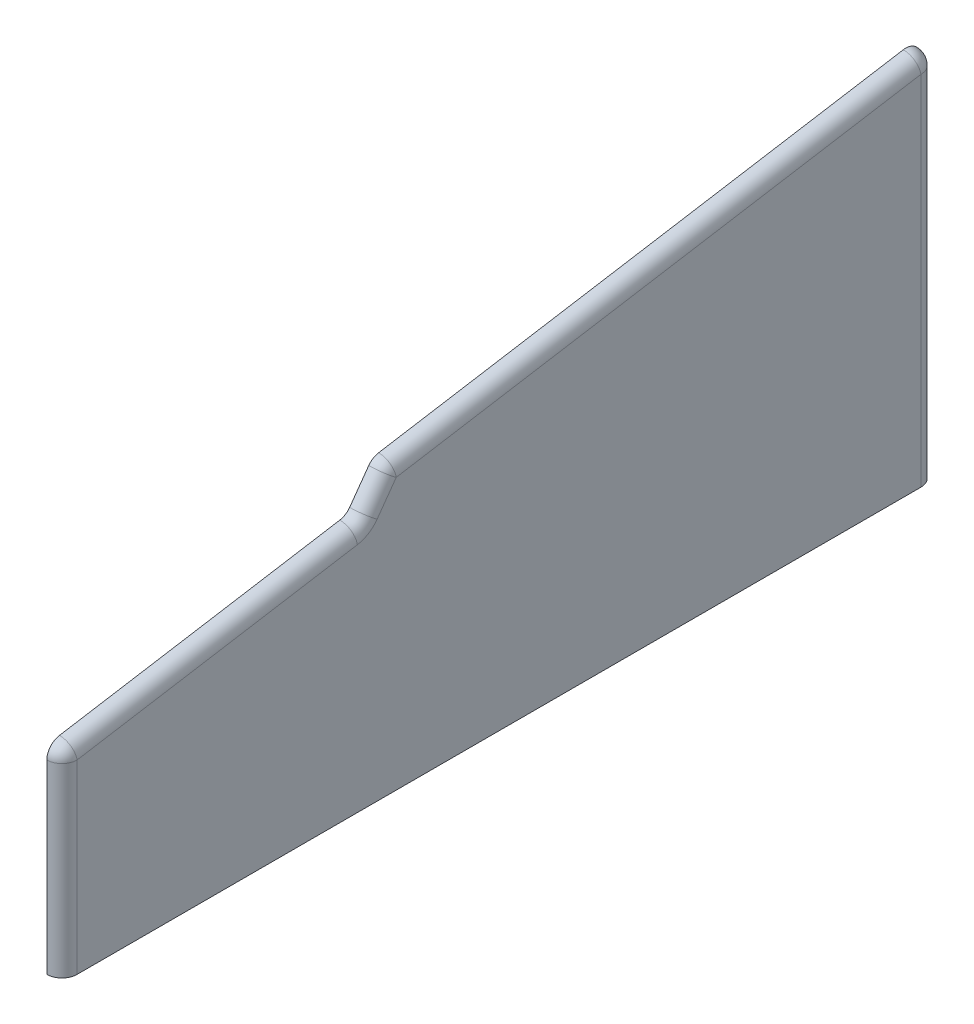
ISO-10303-21;
HEADER;
FILE_DESCRIPTION(('STEP AP214'),'2;1');
FILE_NAME('part.step','',(''),(''),'','','');
FILE_SCHEMA(('AUTOMOTIVE_DESIGN { 1 0 10303 214 1 1 1 1 }'));
ENDSEC;
DATA;
#1=APPLICATION_CONTEXT('core data for automotive mechanical design processes');
#2=APPLICATION_PROTOCOL_DEFINITION('international standard','automotive_design',2000,#1);
#3=PRODUCT_CONTEXT('',#1,'mechanical');
#4=PRODUCT('Part','Part','',(#3));
#5=PRODUCT_RELATED_PRODUCT_CATEGORY('part','',(#4));
#6=PRODUCT_DEFINITION_FORMATION('','',#4);
#7=PRODUCT_DEFINITION_CONTEXT('part definition',#1,'design');
#8=PRODUCT_DEFINITION('design','',#6,#7);
#9=PRODUCT_DEFINITION_SHAPE('','',#8);
#10=(LENGTH_UNIT() NAMED_UNIT(*) SI_UNIT(.MILLI.,.METRE.));
#11=(NAMED_UNIT(*) PLANE_ANGLE_UNIT() SI_UNIT($,.RADIAN.));
#12=(NAMED_UNIT(*) SI_UNIT($,.STERADIAN.) SOLID_ANGLE_UNIT());
#13=UNCERTAINTY_MEASURE_WITH_UNIT(LENGTH_MEASURE(1.E-05),#10,'distance_accuracy_value','');
#14=(GEOMETRIC_REPRESENTATION_CONTEXT(3) GLOBAL_UNCERTAINTY_ASSIGNED_CONTEXT((#13)) GLOBAL_UNIT_ASSIGNED_CONTEXT((#10,
#11,#12)) REPRESENTATION_CONTEXT('',''));
#15=CARTESIAN_POINT('',(0.,0.,0.));
#16=DIRECTION('',(0.,0.,1.));
#17=DIRECTION('',(1.,0.,0.));
#18=AXIS2_PLACEMENT_3D('',#15,#16,#17);
#19=CARTESIAN_POINT('',(-327.974562358316,0.,137.10500183886));
#20=DIRECTION('',(0.,0.,-1.));
#21=DIRECTION('',(1.,0.,0.));
#22=AXIS2_PLACEMENT_3D('',#19,#20,#21);
#23=PLANE('',#22);
#24=DIRECTION('',(0.,-1.,0.));
#25=VECTOR('',#24,1.);
#26=CARTESIAN_POINT('',(-325.974562358316,0.,137.10500183886));
#27=LINE('',#26,#25);
#28=CARTESIAN_POINT('',(-325.974562358316,14.690261728625,137.10500183886));
#29=VERTEX_POINT('',#28);
#30=CARTESIAN_POINT('',(-325.974562358316,-0.0195091277780118,137.10500183886));
#31=VERTEX_POINT('',#30);
#32=EDGE_CURVE('E259',#29,#31,#27,.T.);
#33=ORIENTED_EDGE('',*,*,#32,.F.);
#34=DIRECTION('',(1.,0.,0.));
#35=VECTOR('',#34,1.);
#36=CARTESIAN_POINT('',(-327.974562358316,14.690261728625,137.10500183886));
#37=LINE('',#36,#35);
#38=CARTESIAN_POINT('',(-327.974562358316,14.690261728625,137.10500183886));
#39=VERTEX_POINT('',#38);
#40=EDGE_CURVE('E258',#39,#29,#37,.T.);
#41=ORIENTED_EDGE('',*,*,#40,.F.);
#42=DIRECTION('',(0.,-1.,0.));
#43=VECTOR('',#42,1.);
#44=CARTESIAN_POINT('',(-327.974562358316,0.,137.10500183886));
#45=LINE('',#44,#43);
#46=CARTESIAN_POINT('',(-327.974562358316,-0.0195091277780118,137.10500183886));
#47=VERTEX_POINT('',#46);
#48=EDGE_CURVE('E227',#39,#47,#45,.T.);
#49=ORIENTED_EDGE('',*,*,#48,.T.);
#50=DIRECTION('',(1.,0.,0.));
#51=VECTOR('',#50,1.);
#52=CARTESIAN_POINT('',(-327.974562358316,-0.0195091277780118,137.10500183886));
#53=LINE('',#52,#51);
#54=EDGE_CURVE('E288',#47,#31,#53,.T.);
#55=ORIENTED_EDGE('',*,*,#54,.T.);
#56=EDGE_LOOP('',(#33,#41,#49,#55));
#57=FACE_BOUND('',#56,.T.);
#58=ADVANCED_FACE('F40',(#57),#23,.F.);
#59=CARTESIAN_POINT('',(-327.974562358316,-0.0195091277779954,0.));
#60=DIRECTION('',(0.,-1.,0.));
#61=DIRECTION('',(0.,0.,-1.));
#62=AXIS2_PLACEMENT_3D('',#59,#60,#61);
#63=PLANE('',#62);
#64=DIRECTION('',(0.,0.,1.));
#65=VECTOR('',#64,1.);
#66=CARTESIAN_POINT('',(-325.974562358316,-0.0195091277779954,0.));
#67=LINE('',#66,#65);
#68=CARTESIAN_POINT('',(-325.974562358316,-0.0195091277780113,129.50500183886));
#69=VERTEX_POINT('',#68);
#70=EDGE_CURVE('E231',#69,#31,#67,.T.);
#71=ORIENTED_EDGE('',*,*,#70,.T.);
#72=ORIENTED_EDGE('',*,*,#54,.F.);
#73=DIRECTION('',(0.,0.,1.));
#74=VECTOR('',#73,1.);
#75=CARTESIAN_POINT('',(-327.974562358316,-0.0195091277779954,0.));
#76=LINE('',#75,#74);
#77=CARTESIAN_POINT('',(-327.974562358316,-0.0195091277780113,129.50500183886));
#78=VERTEX_POINT('',#77);
#79=EDGE_CURVE('E256',#78,#47,#76,.T.);
#80=ORIENTED_EDGE('',*,*,#79,.F.);
#81=DIRECTION('',(1.,0.,0.));
#82=VECTOR('',#81,1.);
#83=CARTESIAN_POINT('',(-327.974562358316,-0.0195091277780113,129.50500183886));
#84=LINE('',#83,#82);
#85=EDGE_CURVE('E291',#78,#69,#84,.T.);
#86=ORIENTED_EDGE('',*,*,#85,.T.);
#87=EDGE_LOOP('',(#71,#72,#80,#86));
#88=FACE_BOUND('',#87,.T.);
#89=ADVANCED_FACE('F385',(#88),#63,.T.);
#90=CARTESIAN_POINT('',(-327.974562358316,2.20756218874649E-13,129.50500183886));
#91=DIRECTION('',(0.,0.,1.));
#92=DIRECTION('',(0.,-1.,0.));
#93=AXIS2_PLACEMENT_3D('',#90,#91,#92);
#94=PLANE('',#93);
#95=DIRECTION('',(0.,1.,0.));
#96=VECTOR('',#95,1.);
#97=CARTESIAN_POINT('',(-325.974562358316,2.20756218874649E-13,129.50500183886));
#98=LINE('',#97,#96);
#99=CARTESIAN_POINT('',(-325.974562358316,-16.3021121251671,129.50500183886));
#100=VERTEX_POINT('',#99);
#101=EDGE_CURVE('E285',#100,#69,#98,.T.);
#102=ORIENTED_EDGE('',*,*,#101,.T.);
#103=ORIENTED_EDGE('',*,*,#85,.F.);
#104=DIRECTION('',(0.,1.,0.));
#105=VECTOR('',#104,1.);
#106=CARTESIAN_POINT('',(-327.974562358316,2.20756218874649E-13,129.50500183886));
#107=LINE('',#106,#105);
#108=CARTESIAN_POINT('',(-327.974562358316,-16.3021121251671,129.50500183886));
#109=VERTEX_POINT('',#108);
#110=EDGE_CURVE('E254',#109,#78,#107,.T.);
#111=ORIENTED_EDGE('',*,*,#110,.F.);
#112=DIRECTION('',(1.,0.,0.));
#113=VECTOR('',#112,1.);
#114=CARTESIAN_POINT('',(-327.974562358316,-16.3021121251671,129.50500183886));
#115=LINE('',#114,#113);
#116=EDGE_CURVE('E294',#109,#100,#115,.T.);
#117=ORIENTED_EDGE('',*,*,#116,.T.);
#118=EDGE_LOOP('',(#102,#103,#111,#117));
#119=FACE_BOUND('',#118,.T.);
#120=ADVANCED_FACE('F391',(#119),#94,.T.);
#121=CARTESIAN_POINT('',(-327.974562358316,-16.3021121251671,0.));
#122=DIRECTION('',(0.,-1.,0.));
#123=DIRECTION('',(0.,0.,-1.));
#124=AXIS2_PLACEMENT_3D('',#121,#122,#123);
#125=PLANE('',#124);
#126=DIRECTION('',(0.,0.,1.));
#127=VECTOR('',#126,1.);
#128=CARTESIAN_POINT('',(-325.974562358316,-16.3021121251671,0.));
#129=LINE('',#128,#127);
#130=CARTESIAN_POINT('',(-325.974562358316,-16.3021121251671,-21.8489705992885));
#131=VERTEX_POINT('',#130);
#132=EDGE_CURVE('E283',#131,#100,#129,.T.);
#133=ORIENTED_EDGE('',*,*,#132,.T.);
#134=ORIENTED_EDGE('',*,*,#116,.F.);
#135=DIRECTION('',(0.,0.,1.));
#136=VECTOR('',#135,1.);
#137=CARTESIAN_POINT('',(-327.974562358316,-16.3021121251671,0.));
#138=LINE('',#137,#136);
#139=CARTESIAN_POINT('',(-327.974562358316,-16.3021121251671,-21.8489705992885));
#140=VERTEX_POINT('',#139);
#141=EDGE_CURVE('E252',#140,#109,#138,.T.);
#142=ORIENTED_EDGE('',*,*,#141,.F.);
#143=DIRECTION('',(1.,0.,0.));
#144=VECTOR('',#143,1.);
#145=CARTESIAN_POINT('',(-327.974562358316,-16.3021121251671,-21.8489705992885));
#146=LINE('',#145,#144);
#147=EDGE_CURVE('E297',#140,#131,#146,.T.);
#148=ORIENTED_EDGE('',*,*,#147,.T.);
#149=EDGE_LOOP('',(#133,#134,#142,#148));
#150=FACE_BOUND('',#149,.T.);
#151=ADVANCED_FACE('F526',(#150),#125,.T.);
#152=CARTESIAN_POINT('',(-327.974562358316,0.,-21.8489705992885));
#153=DIRECTION('',(0.,0.,-1.));
#154=DIRECTION('',(1.,0.,0.));
#155=AXIS2_PLACEMENT_3D('',#152,#153,#154);
#156=PLANE('',#155);
#157=DIRECTION('',(0.,-1.,0.));
#158=VECTOR('',#157,1.);
#159=CARTESIAN_POINT('',(-325.974562358316,0.,-21.8489705992885));
#160=LINE('',#159,#158);
#161=CARTESIAN_POINT('',(-325.974562358316,-0.0195091277780118,-21.8489705992885));
#162=VERTEX_POINT('',#161);
#163=EDGE_CURVE('E281',#162,#131,#160,.T.);
#164=ORIENTED_EDGE('',*,*,#163,.T.);
#165=ORIENTED_EDGE('',*,*,#147,.F.);
#166=DIRECTION('',(0.,-1.,0.));
#167=VECTOR('',#166,1.);
#168=CARTESIAN_POINT('',(-327.974562358316,0.,-21.8489705992885));
#169=LINE('',#168,#167);
#170=CARTESIAN_POINT('',(-327.974562358316,-0.0195091277780118,-21.8489705992885));
#171=VERTEX_POINT('',#170);
#172=EDGE_CURVE('E250',#171,#140,#169,.T.);
#173=ORIENTED_EDGE('',*,*,#172,.F.);
#174=DIRECTION('',(1.,0.,0.));
#175=VECTOR('',#174,1.);
#176=CARTESIAN_POINT('',(-327.974562358316,-0.0195091277780118,-21.8489705992885));
#177=LINE('',#176,#175);
#178=EDGE_CURVE('E300',#171,#162,#177,.T.);
#179=ORIENTED_EDGE('',*,*,#178,.T.);
#180=EDGE_LOOP('',(#164,#165,#173,#179));
#181=FACE_BOUND('',#180,.T.);
#182=ADVANCED_FACE('F516',(#181),#156,.T.);
#183=CARTESIAN_POINT('',(-327.974562358316,-0.0195091277780118,0.));
#184=DIRECTION('',(0.,1.,0.));
#185=DIRECTION('',(0.,0.,1.));
#186=AXIS2_PLACEMENT_3D('',#183,#184,#185);
#187=PLANE('',#186);
#188=DIRECTION('',(0.,0.,-1.));
#189=VECTOR('',#188,1.);
#190=CARTESIAN_POINT('',(-325.974562358316,-0.0195091277780118,0.));
#191=LINE('',#190,#189);
#192=CARTESIAN_POINT('',(-325.974562358316,-0.0195091277780118,-29.4489705992885));
#193=VERTEX_POINT('',#192);
#194=EDGE_CURVE('E278',#162,#193,#191,.T.);
#195=ORIENTED_EDGE('',*,*,#194,.F.);
#196=ORIENTED_EDGE('',*,*,#178,.F.);
#197=DIRECTION('',(0.,0.,-1.));
#198=VECTOR('',#197,1.);
#199=CARTESIAN_POINT('',(-327.974562358316,-0.0195091277780118,0.));
#200=LINE('',#199,#198);
#201=CARTESIAN_POINT('',(-327.974562358316,-0.0195091277780118,-29.4489705992885));
#202=VERTEX_POINT('',#201);
#203=EDGE_CURVE('E247',#171,#202,#200,.T.);
#204=ORIENTED_EDGE('',*,*,#203,.T.);
#205=DIRECTION('',(1.,0.,0.));
#206=VECTOR('',#205,1.);
#207=CARTESIAN_POINT('',(-327.974562358316,-0.0195091277780118,-29.4489705992885));
#208=LINE('',#207,#206);
#209=EDGE_CURVE('E303',#202,#193,#208,.T.);
#210=ORIENTED_EDGE('',*,*,#209,.T.);
#211=EDGE_LOOP('',(#195,#196,#204,#210));
#212=FACE_BOUND('',#211,.T.);
#213=ADVANCED_FACE('F506',(#212),#187,.F.);
#214=CARTESIAN_POINT('',(-327.974562358316,0.,-29.4489705992885));
#215=DIRECTION('',(0.,0.,1.));
#216=DIRECTION('',(-1.,0.,0.));
#217=AXIS2_PLACEMENT_3D('',#214,#215,#216);
#218=PLANE('',#217);
#219=DIRECTION('',(0.,1.,0.));
#220=VECTOR('',#219,1.);
#221=CARTESIAN_POINT('',(-325.974562358316,0.,-29.4489705992885));
#222=LINE('',#221,#220);
#223=CARTESIAN_POINT('',(-325.974562358316,47.708117707001,-29.4489705992885));
#224=VERTEX_POINT('',#223);
#225=EDGE_CURVE('E275',#193,#224,#222,.T.);
#226=ORIENTED_EDGE('',*,*,#225,.F.);
#227=ORIENTED_EDGE('',*,*,#209,.F.);
#228=DIRECTION('',(0.,1.,0.));
#229=VECTOR('',#228,1.);
#230=CARTESIAN_POINT('',(-327.974562358316,0.,-29.4489705992885));
#231=LINE('',#230,#229);
#232=CARTESIAN_POINT('',(-327.974562358316,47.708117707001,-29.4489705992885));
#233=VERTEX_POINT('',#232);
#234=EDGE_CURVE('E244',#202,#233,#231,.T.);
#235=ORIENTED_EDGE('',*,*,#234,.T.);
#236=DIRECTION('',(1.,0.,0.));
#237=VECTOR('',#236,1.);
#238=CARTESIAN_POINT('',(-327.974562358316,47.708117707001,-29.4489705992885));
#239=LINE('',#238,#237);
#240=EDGE_CURVE('E306',#233,#224,#239,.T.);
#241=ORIENTED_EDGE('',*,*,#240,.T.);
#242=EDGE_LOOP('',(#226,#227,#235,#241));
#243=FACE_BOUND('',#242,.T.);
#244=ADVANCED_FACE('F496',(#243),#218,.F.);
#245=CARTESIAN_POINT('',(-327.974562358316,47.708117707001,-26.6489705992885));
#246=DIRECTION('',(1.,0.,0.));
#247=DIRECTION('',(0.,0.,1.));
#248=AXIS2_PLACEMENT_3D('',#245,#246,#247);
#249=CYLINDRICAL_SURFACE('',#248,2.8);
#250=CARTESIAN_POINT('',(-325.974562358316,47.708117707001,-26.6489705992885));
#251=DIRECTION('',(-1.,0.,0.));
#252=DIRECTION('',(0.,0.,1.));
#253=AXIS2_PLACEMENT_3D('',#250,#251,#252);
#254=CIRCLE('',#253,2.8);
#255=CARTESIAN_POINT('',(-325.974562358316,50.4706843968319,-26.1926535119064));
#256=VERTEX_POINT('',#255);
#257=EDGE_CURVE('E273',#256,#224,#254,.T.);
#258=ORIENTED_EDGE('',*,*,#257,.T.);
#259=ORIENTED_EDGE('',*,*,#240,.F.);
#260=CARTESIAN_POINT('',(-327.974562358316,47.708117707001,-26.6489705992885));
#261=DIRECTION('',(-1.,0.,0.));
#262=DIRECTION('',(0.,0.,1.));
#263=AXIS2_PLACEMENT_3D('',#260,#261,#262);
#264=CIRCLE('',#263,2.8);
#265=CARTESIAN_POINT('',(-327.974562358316,50.4706843968319,-26.1926535119064));
#266=VERTEX_POINT('',#265);
#267=EDGE_CURVE('E242',#266,#233,#264,.T.);
#268=ORIENTED_EDGE('',*,*,#267,.F.);
#269=DIRECTION('',(1.,0.,0.));
#270=VECTOR('',#269,1.);
#271=CARTESIAN_POINT('',(-327.974562358316,50.4706843968319,-26.1926535119064));
#272=LINE('',#271,#270);
#273=EDGE_CURVE('E309',#266,#256,#272,.T.);
#274=ORIENTED_EDGE('',*,*,#273,.T.);
#275=EDGE_LOOP('',(#258,#259,#268,#274));
#276=FACE_BOUND('',#275,.T.);
#277=ADVANCED_FACE('F486',(#276),#249,.T.);
#278=CARTESIAN_POINT('',(-327.974562358316,44.9186564788282,7.41960386657439));
#279=DIRECTION('',(0.,-0.98663096065388,-0.162970388350771));
#280=DIRECTION('',(0.,0.162970388350771,-0.98663096065388));
#281=AXIS2_PLACEMENT_3D('',#278,#279,#280);
#282=PLANE('',#281);
#283=DIRECTION('',(0.,-0.162970388350771,0.98663096065388));
#284=VECTOR('',#283,1.);
#285=CARTESIAN_POINT('',(-325.974562358316,44.9186564788282,7.41960386657439));
#286=LINE('',#285,#284);
#287=CARTESIAN_POINT('',(-325.974562358316,33.912543623929,74.0511668700437));
#288=VERTEX_POINT('',#287);
#289=EDGE_CURVE('E270',#256,#288,#286,.T.);
#290=ORIENTED_EDGE('',*,*,#289,.F.);
#291=ORIENTED_EDGE('',*,*,#273,.F.);
#292=DIRECTION('',(0.,-0.162970388350771,0.98663096065388));
#293=VECTOR('',#292,1.);
#294=CARTESIAN_POINT('',(-327.974562358316,44.9186564788282,7.41960386657439));
#295=LINE('',#294,#293);
#296=CARTESIAN_POINT('',(-327.974562358316,33.912543623929,74.0511668700437));
#297=VERTEX_POINT('',#296);
#298=EDGE_CURVE('E239',#266,#297,#295,.T.);
#299=ORIENTED_EDGE('',*,*,#298,.T.);
#300=DIRECTION('',(1.,0.,0.));
#301=VECTOR('',#300,1.);
#302=CARTESIAN_POINT('',(-327.974562358316,33.912543623929,74.0511668700437));
#303=LINE('',#302,#301);
#304=EDGE_CURVE('E312',#297,#288,#303,.T.);
#305=ORIENTED_EDGE('',*,*,#304,.T.);
#306=EDGE_LOOP('',(#290,#291,#299,#305));
#307=FACE_BOUND('',#306,.T.);
#308=ADVANCED_FACE('F476',(#307),#282,.F.);
#309=CARTESIAN_POINT('',(-327.974562358316,46.5622513804118,64.9879681018858));
#310=DIRECTION('',(0.,-0.582415976071519,-0.812890909542394));
#311=DIRECTION('',(0.,0.812890909542394,-0.582415976071519));
#312=AXIS2_PLACEMENT_3D('',#309,#310,#311);
#313=PLANE('',#312);
#314=DIRECTION('',(0.,-0.812890909542394,0.582415976071519));
#315=VECTOR('',#314,1.);
#316=CARTESIAN_POINT('',(-325.974562358316,46.5622513804118,64.9879681018858));
#317=LINE('',#316,#315);
#318=CARTESIAN_POINT('',(-325.974562358316,26.6175096435601,79.2778759970325));
#319=VERTEX_POINT('',#318);
#320=EDGE_CURVE('E267',#288,#319,#317,.T.);
#321=ORIENTED_EDGE('',*,*,#320,.F.);
#322=ORIENTED_EDGE('',*,*,#304,.F.);
#323=DIRECTION('',(0.,-0.812890909542394,0.582415976071519));
#324=VECTOR('',#323,1.);
#325=CARTESIAN_POINT('',(-327.974562358316,46.5622513804118,64.9879681018858));
#326=LINE('',#325,#324);
#327=CARTESIAN_POINT('',(-327.974562358316,26.6175096435601,79.2778759970325));
#328=VERTEX_POINT('',#327);
#329=EDGE_CURVE('E236',#297,#328,#326,.T.);
#330=ORIENTED_EDGE('',*,*,#329,.T.);
#331=DIRECTION('',(1.,0.,0.));
#332=VECTOR('',#331,1.);
#333=CARTESIAN_POINT('',(-327.974562358316,26.6175096435601,79.2778759970325));
#334=LINE('',#333,#332);
#335=EDGE_CURVE('E315',#328,#319,#334,.T.);
#336=ORIENTED_EDGE('',*,*,#335,.T.);
#337=EDGE_LOOP('',(#321,#322,#330,#336));
#338=FACE_BOUND('',#337,.T.);
#339=ADVANCED_FACE('F467',(#338),#313,.F.);
#340=CARTESIAN_POINT('',(-327.974562358316,38.6577849251494,6.38544143988436));
#341=DIRECTION('',(0.,-0.98663096065388,-0.162970388350771));
#342=DIRECTION('',(0.,0.162970388350771,-0.98663096065388));
#343=AXIS2_PLACEMENT_3D('',#340,#341,#342);
#344=PLANE('',#343);
#345=DIRECTION('',(0.,-0.162970388350772,0.98663096065388));
#346=VECTOR('',#345,1.);
#347=CARTESIAN_POINT('',(-325.974562358316,38.6577849251494,6.38544143988436));
#348=LINE('',#347,#346);
#349=CARTESIAN_POINT('',(-325.974562358316,17.4528284184559,134.761318926242));
#350=VERTEX_POINT('',#349);
#351=EDGE_CURVE('E264',#319,#350,#348,.T.);
#352=ORIENTED_EDGE('',*,*,#351,.F.);
#353=ORIENTED_EDGE('',*,*,#335,.F.);
#354=DIRECTION('',(0.,-0.162970388350772,0.98663096065388));
#355=VECTOR('',#354,1.);
#356=CARTESIAN_POINT('',(-327.974562358316,38.6577849251494,6.38544143988436));
#357=LINE('',#356,#355);
#358=CARTESIAN_POINT('',(-327.974562358316,17.4528284184559,134.761318926242));
#359=VERTEX_POINT('',#358);
#360=EDGE_CURVE('E233',#328,#359,#357,.T.);
#361=ORIENTED_EDGE('',*,*,#360,.T.);
#362=DIRECTION('',(1.,0.,0.));
#363=VECTOR('',#362,1.);
#364=CARTESIAN_POINT('',(-327.974562358316,17.4528284184559,134.761318926242));
#365=LINE('',#364,#363);
#366=EDGE_CURVE('E318',#359,#350,#365,.T.);
#367=ORIENTED_EDGE('',*,*,#366,.T.);
#368=EDGE_LOOP('',(#352,#353,#361,#367));
#369=FACE_BOUND('',#368,.T.);
#370=ADVANCED_FACE('F458',(#369),#344,.F.);
#371=CARTESIAN_POINT('',(-327.974562358316,14.690261728625,134.30500183886));
#372=DIRECTION('',(1.,0.,0.));
#373=DIRECTION('',(0.,0.,1.));
#374=AXIS2_PLACEMENT_3D('',#371,#372,#373);
#375=CYLINDRICAL_SURFACE('',#374,2.8);
#376=CARTESIAN_POINT('',(-325.974562358316,14.690261728625,134.30500183886));
#377=DIRECTION('',(-1.,0.,0.));
#378=DIRECTION('',(0.,0.,1.));
#379=AXIS2_PLACEMENT_3D('',#376,#377,#378);
#380=CIRCLE('',#379,2.8);
#381=EDGE_CURVE('E262',#29,#350,#380,.T.);
#382=ORIENTED_EDGE('',*,*,#381,.T.);
#383=ORIENTED_EDGE('',*,*,#366,.F.);
#384=CARTESIAN_POINT('',(-327.974562358316,14.690261728625,134.30500183886));
#385=DIRECTION('',(-1.,0.,0.));
#386=DIRECTION('',(0.,0.,1.));
#387=AXIS2_PLACEMENT_3D('',#384,#385,#386);
#388=CIRCLE('',#387,2.8);
#389=EDGE_CURVE('E230',#39,#359,#388,.T.);
#390=ORIENTED_EDGE('',*,*,#389,.F.);
#391=ORIENTED_EDGE('',*,*,#40,.T.);
#392=EDGE_LOOP('',(#382,#383,#390,#391));
#393=FACE_BOUND('',#392,.T.);
#394=ADVANCED_FACE('F397',(#393),#375,.T.);
#395=CARTESIAN_POINT('',(-327.974562358316,0.,0.));
#396=DIRECTION('',(1.,0.,0.));
#397=DIRECTION('',(0.,0.,1.));
#398=AXIS2_PLACEMENT_3D('',#395,#396,#397);
#399=PLANE('',#398);
#400=ORIENTED_EDGE('',*,*,#48,.F.);
#401=ORIENTED_EDGE('',*,*,#389,.T.);
#402=ORIENTED_EDGE('',*,*,#360,.F.);
#403=ORIENTED_EDGE('',*,*,#329,.F.);
#404=ORIENTED_EDGE('',*,*,#298,.F.);
#405=ORIENTED_EDGE('',*,*,#267,.T.);
#406=ORIENTED_EDGE('',*,*,#234,.F.);
#407=ORIENTED_EDGE('',*,*,#203,.F.);
#408=ORIENTED_EDGE('',*,*,#172,.T.);
#409=ORIENTED_EDGE('',*,*,#141,.T.);
#410=ORIENTED_EDGE('',*,*,#110,.T.);
#411=ORIENTED_EDGE('',*,*,#79,.T.);
#412=EDGE_LOOP('',(#400,#401,#402,#403,#404,#405,#406,#407,#408,#409,#410,#411));
#413=FACE_BOUND('',#412,.T.);
#414=ADVANCED_FACE('F382',(#413),#399,.F.);
#415=CARTESIAN_POINT('',(-322.974562358316,-19.5021121251671,0.));
#416=DIRECTION('',(0.,1.,0.));
#417=DIRECTION('',(0.,0.,1.));
#418=AXIS2_PLACEMENT_3D('',#415,#416,#417);
#419=PLANE('',#418);
#420=DIRECTION('',(0.,0.,1.));
#421=VECTOR('',#420,1.);
#422=CARTESIAN_POINT('',(-322.974562358316,-19.5021121251671,0.));
#423=LINE('',#422,#421);
#424=CARTESIAN_POINT('',(-322.974562358316,-19.5021121251671,-29.6489705992885));
#425=VERTEX_POINT('',#424);
#426=CARTESIAN_POINT('',(-322.974562358316,-19.5021121251671,137.30500183886));
#427=VERTEX_POINT('',#426);
#428=EDGE_CURVE('E206',#425,#427,#423,.T.);
#429=ORIENTED_EDGE('',*,*,#428,.T.);
#430=CARTESIAN_POINT('',(-325.974562358316,-19.5021121251671,137.30500183886));
#431=DIRECTION('',(0.,-1.,0.));
#432=DIRECTION('',(0.,0.,1.));
#433=AXIS2_PLACEMENT_3D('',#430,#431,#432);
#434=CIRCLE('',#433,3.);
#435=CARTESIAN_POINT('',(-325.974562358316,-19.5021121251671,140.30500183886));
#436=VERTEX_POINT('',#435);
#437=EDGE_CURVE('E49',#436,#427,#434,.F.);
#438=ORIENTED_EDGE('',*,*,#437,.F.);
#439=DIRECTION('',(0.,0.,1.));
#440=VECTOR('',#439,1.);
#441=CARTESIAN_POINT('',(-325.974562358316,-19.5021121251671,0.));
#442=LINE('',#441,#440);
#443=CARTESIAN_POINT('',(-325.974562358316,-19.5021121251671,-32.6489705992885));
#444=VERTEX_POINT('',#443);
#445=EDGE_CURVE('E202',#444,#436,#442,.T.);
#446=ORIENTED_EDGE('',*,*,#445,.F.);
#447=CARTESIAN_POINT('',(-325.974562358316,-19.5021121251671,-29.6489705992885));
#448=DIRECTION('',(0.,-1.,0.));
#449=DIRECTION('',(0.,0.,1.));
#450=AXIS2_PLACEMENT_3D('',#447,#448,#449);
#451=CIRCLE('',#450,3.);
#452=EDGE_CURVE('E11',#425,#444,#451,.F.);
#453=ORIENTED_EDGE('',*,*,#452,.F.);
#454=EDGE_LOOP('',(#429,#438,#446,#453));
#455=FACE_BOUND('',#454,.T.);
#456=ADVANCED_FACE('F371',(#455),#419,.F.);
#457=CARTESIAN_POINT('',(-322.974562358316,0.,0.));
#458=DIRECTION('',(1.,0.,0.));
#459=DIRECTION('',(0.,0.,1.));
#460=AXIS2_PLACEMENT_3D('',#457,#458,#459);
#461=PLANE('',#460);
#462=DIRECTION('',(0.,0.162970388350771,-0.98663096065388));
#463=VECTOR('',#462,1.);
#464=CARTESIAN_POINT('',(-322.974562358316,51.2443042896114,-29.6489705992885));
#465=LINE('',#464,#463);
#466=CARTESIAN_POINT('',(-322.974562358316,34.0963689070357,74.1654961327059));
#467=VERTEX_POINT('',#466);
#468=CARTESIAN_POINT('',(-322.974562358316,51.2443042896114,-29.6489705992885));
#469=VERTEX_POINT('',#468);
#470=EDGE_CURVE('E333',#467,#469,#465,.T.);
#471=ORIENTED_EDGE('',*,*,#470,.F.);
#472=DIRECTION('',(0.,0.812890909542392,-0.582415976071521));
#473=VECTOR('',#472,1.);
#474=CARTESIAN_POINT('',(-322.974562358316,34.0963689070357,74.1654961327059));
#475=LINE('',#474,#473);
#476=CARTESIAN_POINT('',(-322.974562358316,28.8215975634404,77.9447376823051));
#477=VERTEX_POINT('',#476);
#478=EDGE_CURVE('E330',#477,#467,#475,.T.);
#479=ORIENTED_EDGE('',*,*,#478,.F.);
#480=CARTESIAN_POINT('',(-322.974562358316,32.3160934198696,82.8220831395595));
#481=DIRECTION('',(-1.,0.,0.));
#482=DIRECTION('',(0.,0.,1.));
#483=AXIS2_PLACEMENT_3D('',#480,#481,#482);
#484=CIRCLE('',#483,6.);
#485=CARTESIAN_POINT('',(-322.974562358316,26.3963076559463,81.8442608094548));
#486=VERTEX_POINT('',#485);
#487=EDGE_CURVE('E327',#486,#477,#484,.F.);
#488=ORIENTED_EDGE('',*,*,#487,.F.);
#489=DIRECTION('',(0.,0.162970388350772,-0.98663096065388));
#490=VECTOR('',#489,1.);
#491=CARTESIAN_POINT('',(-322.974562358316,26.3963076559463,81.8442608094549));
#492=LINE('',#491,#490);
#493=CARTESIAN_POINT('',(-322.974562358316,17.2353763004235,137.30500183886));
#494=VERTEX_POINT('',#493);
#495=EDGE_CURVE('E324',#494,#486,#492,.T.);
#496=ORIENTED_EDGE('',*,*,#495,.F.);
#497=DIRECTION('',(0.,1.,0.));
#498=VECTOR('',#497,1.);
#499=CARTESIAN_POINT('',(-322.974562358316,17.2353763004235,137.30500183886));
#500=LINE('',#499,#498);
#501=EDGE_CURVE('E188',#427,#494,#500,.T.);
#502=ORIENTED_EDGE('',*,*,#501,.F.);
#503=ORIENTED_EDGE('',*,*,#428,.F.);
#504=DIRECTION('',(0.,-1.,0.));
#505=VECTOR('',#504,1.);
#506=CARTESIAN_POINT('',(-322.974562358316,-19.5021121251671,-29.6489705992885));
#507=LINE('',#506,#505);
#508=EDGE_CURVE('E335',#469,#425,#507,.T.);
#509=ORIENTED_EDGE('',*,*,#508,.F.);
#510=EDGE_LOOP('',(#471,#479,#488,#496,#502,#503,#509));
#511=FACE_BOUND('',#510,.T.);
#512=ADVANCED_FACE('F373',(#511),#461,.T.);
#513=CARTESIAN_POINT('',(-325.974562358316,0.,0.));
#514=DIRECTION('',(1.,0.,0.));
#515=DIRECTION('',(0.,0.,1.));
#516=AXIS2_PLACEMENT_3D('',#513,#514,#515);
#517=PLANE('',#516);
#518=ORIENTED_EDGE('',*,*,#32,.T.);
#519=ORIENTED_EDGE('',*,*,#70,.F.);
#520=ORIENTED_EDGE('',*,*,#101,.F.);
#521=ORIENTED_EDGE('',*,*,#132,.F.);
#522=ORIENTED_EDGE('',*,*,#163,.F.);
#523=ORIENTED_EDGE('',*,*,#194,.T.);
#524=ORIENTED_EDGE('',*,*,#225,.T.);
#525=ORIENTED_EDGE('',*,*,#257,.F.);
#526=ORIENTED_EDGE('',*,*,#289,.T.);
#527=ORIENTED_EDGE('',*,*,#320,.T.);
#528=ORIENTED_EDGE('',*,*,#351,.T.);
#529=ORIENTED_EDGE('',*,*,#381,.F.);
#530=EDGE_LOOP('',(#518,#519,#520,#521,#522,#523,#524,#525,#526,#527,#528,#529));
#531=FACE_BOUND('',#530,.T.);
#532=DIRECTION('',(0.,1.,0.));
#533=VECTOR('',#532,1.);
#534=CARTESIAN_POINT('',(-325.974562358316,0.,140.30500183886));
#535=LINE('',#534,#533);
#536=CARTESIAN_POINT('',(-325.974562358316,17.2353763004235,140.30500183886));
#537=VERTEX_POINT('',#536);
#538=EDGE_CURVE('E186',#436,#537,#535,.T.);
#539=ORIENTED_EDGE('',*,*,#538,.T.);
#540=CARTESIAN_POINT('',(-325.974562358316,17.2353763004235,137.30500183886));
#541=DIRECTION('',(-1.,0.,0.));
#542=DIRECTION('',(0.,0.,1.));
#543=AXIS2_PLACEMENT_3D('',#540,#541,#542);
#544=CIRCLE('',#543,3.);
#545=CARTESIAN_POINT('',(-325.974562358316,20.1952691823851,137.793913003912));
#546=VERTEX_POINT('',#545);
#547=EDGE_CURVE('E193',#537,#546,#544,.T.);
#548=ORIENTED_EDGE('',*,*,#547,.T.);
#549=DIRECTION('',(0.,0.162970388350772,-0.98663096065388));
#550=VECTOR('',#549,1.);
#551=CARTESIAN_POINT('',(-325.974562358316,41.8150039992419,6.90694668260686));
#552=LINE('',#551,#550);
#553=CARTESIAN_POINT('',(-325.974562358316,29.3562005379079,82.3331719745072));
#554=VERTEX_POINT('',#553);
#555=EDGE_CURVE('E198',#546,#554,#552,.T.);
#556=ORIENTED_EDGE('',*,*,#555,.T.);
#557=CARTESIAN_POINT('',(-325.974562358316,32.3160934198696,82.8220831395595));
#558=DIRECTION('',(-1.,0.,0.));
#559=DIRECTION('',(0.,0.,1.));
#560=AXIS2_PLACEMENT_3D('',#557,#558,#559);
#561=CIRCLE('',#560,3.);
#562=CARTESIAN_POINT('',(-325.974562358316,30.568845491655,80.3834104109323));
#563=VERTEX_POINT('',#562);
#564=EDGE_CURVE('E209',#554,#563,#561,.F.);
#565=ORIENTED_EDGE('',*,*,#564,.T.);
#566=DIRECTION('',(0.,0.812890909542392,-0.582415976071521));
#567=VECTOR('',#566,1.);
#568=CARTESIAN_POINT('',(-325.974562358316,48.4259825038408,67.5892190124213));
#569=LINE('',#568,#567);
#570=CARTESIAN_POINT('',(-325.974562358316,35.8436168352503,76.6041688613331));
#571=VERTEX_POINT('',#570);
#572=EDGE_CURVE('E212',#563,#571,#569,.T.);
#573=ORIENTED_EDGE('',*,*,#572,.T.);
#574=CARTESIAN_POINT('',(-325.974562358316,34.0963689070357,74.1654961327059));
#575=DIRECTION('',(-1.,0.,0.));
#576=DIRECTION('',(0.,0.,1.));
#577=AXIS2_PLACEMENT_3D('',#574,#575,#576);
#578=CIRCLE('',#577,3.);
#579=CARTESIAN_POINT('',(-325.974562358316,37.0562617889974,74.6544072977582));
#580=VERTEX_POINT('',#579);
#581=EDGE_CURVE('E215',#571,#580,#578,.T.);
#582=ORIENTED_EDGE('',*,*,#581,.T.);
#583=DIRECTION('',(0.,0.162970388350771,-0.98663096065388));
#584=VECTOR('',#583,1.);
#585=CARTESIAN_POINT('',(-325.974562358316,48.0758755529206,7.94110910929685));
#586=LINE('',#585,#584);
#587=CARTESIAN_POINT('',(-325.974562358316,54.2041971715731,-29.1600594342362));
#588=VERTEX_POINT('',#587);
#589=EDGE_CURVE('E218',#580,#588,#586,.T.);
#590=ORIENTED_EDGE('',*,*,#589,.T.);
#591=CARTESIAN_POINT('',(-325.974562358316,51.2443042896114,-29.6489705992885));
#592=DIRECTION('',(-1.,0.,0.));
#593=DIRECTION('',(0.,0.,1.));
#594=AXIS2_PLACEMENT_3D('',#591,#592,#593);
#595=CIRCLE('',#594,3.);
#596=CARTESIAN_POINT('',(-325.974562358316,51.2443042896114,-32.6489705992885));
#597=VERTEX_POINT('',#596);
#598=EDGE_CURVE('E221',#588,#597,#595,.T.);
#599=ORIENTED_EDGE('',*,*,#598,.T.);
#600=DIRECTION('',(0.,-1.,0.));
#601=VECTOR('',#600,1.);
#602=CARTESIAN_POINT('',(-325.974562358316,0.,-32.6489705992885));
#603=LINE('',#602,#601);
#604=EDGE_CURVE('E224',#597,#444,#603,.T.);
#605=ORIENTED_EDGE('',*,*,#604,.T.);
#606=ORIENTED_EDGE('',*,*,#445,.T.);
#607=EDGE_LOOP('',(#539,#548,#556,#565,#573,#582,#590,#599,#605,#606));
#608=FACE_BOUND('',#607,.T.);
#609=ADVANCED_FACE('F200',(#531,#608),#517,.F.);
#610=CARTESIAN_POINT('',(-325.974562358316,0.,137.30500183886));
#611=DIRECTION('',(0.,-1.,0.));
#612=DIRECTION('',(0.,0.,-1.));
#613=AXIS2_PLACEMENT_3D('',#610,#611,#612);
#614=CYLINDRICAL_SURFACE('',#613,3.);
#615=ORIENTED_EDGE('',*,*,#437,.T.);
#616=ORIENTED_EDGE('',*,*,#501,.T.);
#617=CARTESIAN_POINT('',(-325.974562358316,17.2353763004235,137.30500183886));
#618=DIRECTION('',(0.,-1.,0.));
#619=DIRECTION('',(0.,0.,1.));
#620=AXIS2_PLACEMENT_3D('',#617,#618,#619);
#621=CIRCLE('',#620,3.);
#622=EDGE_CURVE('E44',#494,#537,#621,.T.);
#623=ORIENTED_EDGE('',*,*,#622,.T.);
#624=ORIENTED_EDGE('',*,*,#538,.F.);
#625=EDGE_LOOP('',(#615,#616,#623,#624));
#626=FACE_BOUND('',#625,.T.);
#627=ADVANCED_FACE('F42',(#626),#614,.T.);
#628=CARTESIAN_POINT('',(-325.974562358316,17.2353763004235,137.30500183886));
#629=DIRECTION('',(1.,0.,0.));
#630=DIRECTION('',(0.,0.,1.));
#631=AXIS2_PLACEMENT_3D('',#628,#629,#630);
#632=SPHERICAL_SURFACE('',#631,3.);
#633=ORIENTED_EDGE('',*,*,#622,.F.);
#634=CARTESIAN_POINT('',(-325.974562358316,17.2353763004235,137.30500183886));
#635=DIRECTION('',(0.,-0.162970388350771,0.98663096065388));
#636=DIRECTION('',(0.,0.98663096065388,0.162970388350771));
#637=AXIS2_PLACEMENT_3D('',#634,#635,#636);
#638=CIRCLE('',#637,3.);
#639=EDGE_CURVE('E191',#494,#546,#638,.T.);
#640=ORIENTED_EDGE('',*,*,#639,.T.);
#641=ORIENTED_EDGE('',*,*,#547,.F.);
#642=EDGE_LOOP('',(#633,#640,#641));
#643=FACE_BOUND('',#642,.T.);
#644=ADVANCED_FACE('F194',(#643),#632,.T.);
#645=CARTESIAN_POINT('',(-325.974562358316,38.8551111172802,6.41803551755454));
#646=DIRECTION('',(0.,-0.162970388350772,0.98663096065388));
#647=DIRECTION('',(0.,-0.98663096065388,-0.162970388350772));
#648=AXIS2_PLACEMENT_3D('',#645,#646,#647);
#649=CYLINDRICAL_SURFACE('',#648,3.);
#650=ORIENTED_EDGE('',*,*,#639,.F.);
#651=ORIENTED_EDGE('',*,*,#495,.T.);
#652=CARTESIAN_POINT('',(-325.974562358316,26.3963076559463,81.8442608094548));
#653=DIRECTION('',(0.,-0.162970388350776,0.98663096065388));
#654=DIRECTION('',(0.,0.98663096065388,0.162970388350776));
#655=AXIS2_PLACEMENT_3D('',#652,#653,#654);
#656=CIRCLE('',#655,3.);
#657=EDGE_CURVE('E346',#486,#554,#656,.T.);
#658=ORIENTED_EDGE('',*,*,#657,.T.);
#659=ORIENTED_EDGE('',*,*,#555,.F.);
#660=EDGE_LOOP('',(#650,#651,#658,#659));
#661=FACE_BOUND('',#660,.T.);
#662=ADVANCED_FACE('F349',(#661),#649,.T.);
#663=CARTESIAN_POINT('',(-325.974562358316,32.3160934198696,82.8220831395595));
#664=DIRECTION('',(1.,0.,0.));
#665=DIRECTION('',(0.,0.,1.));
#666=AXIS2_PLACEMENT_3D('',#663,#664,#665);
#667=TOROIDAL_SURFACE('',#666,6.,3.);
#668=ORIENTED_EDGE('',*,*,#657,.F.);
#669=ORIENTED_EDGE('',*,*,#487,.T.);
#670=CARTESIAN_POINT('',(-325.974562358316,28.8215975634404,77.9447376823051));
#671=DIRECTION('',(0.,-0.812890909542391,0.582415976071522));
#672=DIRECTION('',(0.,0.582415976071522,0.812890909542391));
#673=AXIS2_PLACEMENT_3D('',#670,#671,#672);
#674=CIRCLE('',#673,3.);
#675=EDGE_CURVE('E344',#477,#563,#674,.T.);
#676=ORIENTED_EDGE('',*,*,#675,.T.);
#677=ORIENTED_EDGE('',*,*,#564,.F.);
#678=EDGE_LOOP('',(#668,#669,#676,#677));
#679=FACE_BOUND('',#678,.T.);
#680=ADVANCED_FACE('F352',(#679),#667,.T.);
#681=CARTESIAN_POINT('',(-325.974562358316,46.6787345756263,65.1505462837941));
#682=DIRECTION('',(0.,-0.812890909542392,0.582415976071521));
#683=DIRECTION('',(0.,-0.582415976071521,-0.812890909542392));
#684=AXIS2_PLACEMENT_3D('',#681,#682,#683);
#685=CYLINDRICAL_SURFACE('',#684,3.);
#686=ORIENTED_EDGE('',*,*,#675,.F.);
#687=ORIENTED_EDGE('',*,*,#478,.T.);
#688=CARTESIAN_POINT('',(-325.974562358316,34.0963689070357,74.1654961327059));
#689=DIRECTION('',(0.,-0.812890909542391,0.582415976071523));
#690=DIRECTION('',(0.,0.582415976071523,0.812890909542391));
#691=AXIS2_PLACEMENT_3D('',#688,#689,#690);
#692=CIRCLE('',#691,3.);
#693=EDGE_CURVE('E342',#467,#571,#692,.T.);
#694=ORIENTED_EDGE('',*,*,#693,.T.);
#695=ORIENTED_EDGE('',*,*,#572,.F.);
#696=EDGE_LOOP('',(#686,#687,#694,#695));
#697=FACE_BOUND('',#696,.T.);
#698=ADVANCED_FACE('F356',(#697),#685,.T.);
#699=CARTESIAN_POINT('',(-325.974562358316,34.0963689070357,74.1654961327059));
#700=DIRECTION('',(1.,0.,0.));
#701=DIRECTION('',(0.,0.,1.));
#702=AXIS2_PLACEMENT_3D('',#699,#700,#701);
#703=SPHERICAL_SURFACE('',#702,3.);
#704=ORIENTED_EDGE('',*,*,#693,.F.);
#705=CARTESIAN_POINT('',(-325.974562358316,34.0963689070357,74.1654961327059));
#706=DIRECTION('',(0.,-0.162970388350771,0.98663096065388));
#707=DIRECTION('',(0.,0.98663096065388,0.162970388350771));
#708=AXIS2_PLACEMENT_3D('',#705,#706,#707);
#709=CIRCLE('',#708,3.);
#710=EDGE_CURVE('E65',#467,#580,#709,.T.);
#711=ORIENTED_EDGE('',*,*,#710,.T.);
#712=ORIENTED_EDGE('',*,*,#581,.F.);
#713=EDGE_LOOP('',(#704,#711,#712));
#714=FACE_BOUND('',#713,.T.);
#715=ADVANCED_FACE('F360',(#714),#703,.T.);
#716=CARTESIAN_POINT('',(-325.974562358316,45.115982670959,7.45219794424453));
#717=DIRECTION('',(0.,-0.162970388350771,0.98663096065388));
#718=DIRECTION('',(0.,-0.98663096065388,-0.162970388350771));
#719=AXIS2_PLACEMENT_3D('',#716,#717,#718);
#720=CYLINDRICAL_SURFACE('',#719,3.);
#721=ORIENTED_EDGE('',*,*,#710,.F.);
#722=ORIENTED_EDGE('',*,*,#470,.T.);
#723=CARTESIAN_POINT('',(-325.974562358316,51.2443042896114,-29.6489705992885));
#724=DIRECTION('',(0.,-0.162970388350771,0.98663096065388));
#725=DIRECTION('',(0.,0.98663096065388,0.162970388350771));
#726=AXIS2_PLACEMENT_3D('',#723,#724,#725);
#727=CIRCLE('',#726,3.);
#728=EDGE_CURVE('E339',#469,#588,#727,.T.);
#729=ORIENTED_EDGE('',*,*,#728,.T.);
#730=ORIENTED_EDGE('',*,*,#589,.F.);
#731=EDGE_LOOP('',(#721,#722,#729,#730));
#732=FACE_BOUND('',#731,.T.);
#733=ADVANCED_FACE('F361',(#732),#720,.T.);
#734=CARTESIAN_POINT('',(-325.974562358316,51.2443042896114,-29.6489705992885));
#735=DIRECTION('',(1.,0.,0.));
#736=DIRECTION('',(0.,0.,1.));
#737=AXIS2_PLACEMENT_3D('',#734,#735,#736);
#738=SPHERICAL_SURFACE('',#737,3.);
#739=ORIENTED_EDGE('',*,*,#728,.F.);
#740=CARTESIAN_POINT('',(-325.974562358316,51.2443042896114,-29.6489705992885));
#741=DIRECTION('',(0.,1.,0.));
#742=DIRECTION('',(0.,0.,-1.));
#743=AXIS2_PLACEMENT_3D('',#740,#741,#742);
#744=CIRCLE('',#743,3.);
#745=EDGE_CURVE('E57',#469,#597,#744,.T.);
#746=ORIENTED_EDGE('',*,*,#745,.T.);
#747=ORIENTED_EDGE('',*,*,#598,.F.);
#748=EDGE_LOOP('',(#739,#746,#747));
#749=FACE_BOUND('',#748,.T.);
#750=ADVANCED_FACE('F364',(#749),#738,.T.);
#751=CARTESIAN_POINT('',(-325.974562358316,0.,-29.6489705992885));
#752=DIRECTION('',(0.,1.,0.));
#753=DIRECTION('',(0.,0.,1.));
#754=AXIS2_PLACEMENT_3D('',#751,#752,#753);
#755=CYLINDRICAL_SURFACE('',#754,3.);
#756=ORIENTED_EDGE('',*,*,#745,.F.);
#757=ORIENTED_EDGE('',*,*,#508,.T.);
#758=ORIENTED_EDGE('',*,*,#452,.T.);
#759=ORIENTED_EDGE('',*,*,#604,.F.);
#760=EDGE_LOOP('',(#756,#757,#758,#759));
#761=FACE_BOUND('',#760,.T.);
#762=ADVANCED_FACE('F366',(#761),#755,.T.);
#763=CLOSED_SHELL('',(#58,#89,#120,#151,#182,#213,#244,#277,#308,#339,#370,#394,#414,#456,#512,
#609,#627,#644,#662,#680,#698,#715,#733,#750,#762));
#764=MANIFOLD_SOLID_BREP('B2',#763);
#765=ADVANCED_BREP_SHAPE_REPRESENTATION('',(#18,#764),#14);
#766=SHAPE_DEFINITION_REPRESENTATION(#9,#765);
ENDSEC;
END-ISO-10303-21;
